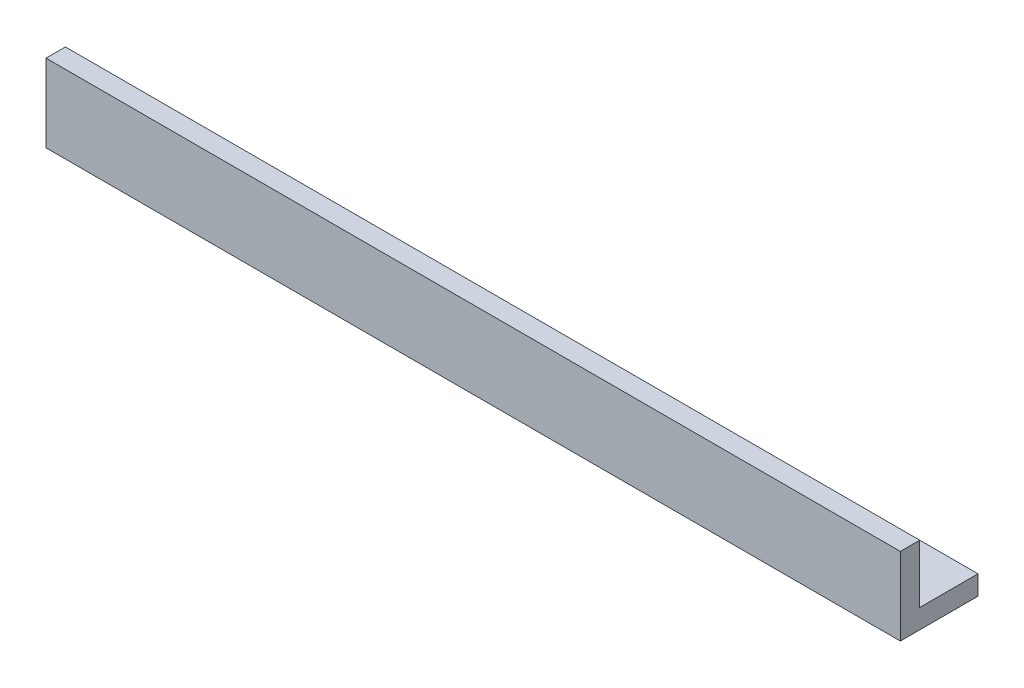
ISO-10303-21;
HEADER;
FILE_DESCRIPTION(('STEP AP214'),'2;1');
FILE_NAME('part.step','',(''),(''),'','','');
FILE_SCHEMA(('AUTOMOTIVE_DESIGN { 1 0 10303 214 1 1 1 1 }'));
ENDSEC;
DATA;
#1=APPLICATION_CONTEXT('core data for automotive mechanical design processes');
#2=APPLICATION_PROTOCOL_DEFINITION('international standard','automotive_design',2000,#1);
#3=PRODUCT_CONTEXT('',#1,'mechanical');
#4=PRODUCT('Part','Part','',(#3));
#5=PRODUCT_RELATED_PRODUCT_CATEGORY('part','',(#4));
#6=PRODUCT_DEFINITION_FORMATION('','',#4);
#7=PRODUCT_DEFINITION_CONTEXT('part definition',#1,'design');
#8=PRODUCT_DEFINITION('design','',#6,#7);
#9=PRODUCT_DEFINITION_SHAPE('','',#8);
#10=(LENGTH_UNIT() NAMED_UNIT(*) SI_UNIT(.MILLI.,.METRE.));
#11=(NAMED_UNIT(*) PLANE_ANGLE_UNIT() SI_UNIT($,.RADIAN.));
#12=(NAMED_UNIT(*) SI_UNIT($,.STERADIAN.) SOLID_ANGLE_UNIT());
#13=UNCERTAINTY_MEASURE_WITH_UNIT(LENGTH_MEASURE(1.E-05),#10,'distance_accuracy_value','');
#14=(GEOMETRIC_REPRESENTATION_CONTEXT(3) GLOBAL_UNCERTAINTY_ASSIGNED_CONTEXT((#13)) GLOBAL_UNIT_ASSIGNED_CONTEXT((#10,
#11,#12)) REPRESENTATION_CONTEXT('',''));
#15=CARTESIAN_POINT('',(0.,0.,0.));
#16=DIRECTION('',(0.,0.,1.));
#17=DIRECTION('',(1.,0.,0.));
#18=AXIS2_PLACEMENT_3D('',#15,#16,#17);
#19=CARTESIAN_POINT('',(-67.9135273568716,28.7042734044365,3.175));
#20=DIRECTION('',(1.,0.,0.));
#21=DIRECTION('',(0.,0.,-1.));
#22=AXIS2_PLACEMENT_3D('',#19,#20,#21);
#23=PLANE('',#22);
#24=DIRECTION('',(0.,-1.,0.));
#25=VECTOR('',#24,1.);
#26=CARTESIAN_POINT('',(-67.9135273568716,28.7042734044365,0.));
#27=LINE('',#26,#25);
#28=CARTESIAN_POINT('',(-67.9135273568716,28.7042734044365,0.));
#29=VERTEX_POINT('',#28);
#30=CARTESIAN_POINT('',(-67.9135273568716,19.1792734044365,0.));
#31=VERTEX_POINT('',#30);
#32=EDGE_CURVE('E135',#29,#31,#27,.T.);
#33=ORIENTED_EDGE('',*,*,#32,.T.);
#34=DIRECTION('',(0.,0.,-1.));
#35=VECTOR('',#34,1.);
#36=CARTESIAN_POINT('',(-67.9135273568716,19.1792734044365,-9.525));
#37=LINE('',#36,#35);
#38=CARTESIAN_POINT('',(-67.9135273568716,19.1792734044365,-9.525));
#39=VERTEX_POINT('',#38);
#40=EDGE_CURVE('E58',#31,#39,#37,.T.);
#41=ORIENTED_EDGE('',*,*,#40,.T.);
#42=DIRECTION('',(0.,-1.,0.));
#43=VECTOR('',#42,1.);
#44=CARTESIAN_POINT('',(-67.9135273568716,19.1792734044365,-9.525));
#45=LINE('',#44,#43);
#46=CARTESIAN_POINT('',(-67.9135273568716,16.0042734044365,-9.525));
#47=VERTEX_POINT('',#46);
#48=EDGE_CURVE('E116',#39,#47,#45,.T.);
#49=ORIENTED_EDGE('',*,*,#48,.T.);
#50=DIRECTION('',(0.,0.,-1.));
#51=VECTOR('',#50,1.);
#52=CARTESIAN_POINT('',(-67.9135273568716,16.0042734044365,3.175));
#53=LINE('',#52,#51);
#54=CARTESIAN_POINT('',(-67.9135273568716,16.0042734044365,3.175));
#55=VERTEX_POINT('',#54);
#56=EDGE_CURVE('E11',#55,#47,#53,.T.);
#57=ORIENTED_EDGE('',*,*,#56,.F.);
#58=DIRECTION('',(0.,-1.,0.));
#59=VECTOR('',#58,1.);
#60=CARTESIAN_POINT('',(-67.9135273568716,28.7042734044365,3.175));
#61=LINE('',#60,#59);
#62=CARTESIAN_POINT('',(-67.9135273568716,28.7042734044365,3.175));
#63=VERTEX_POINT('',#62);
#64=EDGE_CURVE('E147',#63,#55,#61,.T.);
#65=ORIENTED_EDGE('',*,*,#64,.F.);
#66=DIRECTION('',(0.,0.,-1.));
#67=VECTOR('',#66,1.);
#68=CARTESIAN_POINT('',(-67.9135273568716,28.7042734044365,3.175));
#69=LINE('',#68,#67);
#70=EDGE_CURVE('E157',#63,#29,#69,.T.);
#71=ORIENTED_EDGE('',*,*,#70,.T.);
#72=EDGE_LOOP('',(#33,#41,#49,#57,#65,#71));
#73=FACE_BOUND('',#72,.T.);
#74=ADVANCED_FACE('F40',(#73),#23,.F.);
#75=CARTESIAN_POINT('',(-67.9135273568716,16.0042734044365,3.175));
#76=DIRECTION('',(0.,1.,0.));
#77=DIRECTION('',(0.,0.,1.));
#78=AXIS2_PLACEMENT_3D('',#75,#76,#77);
#79=PLANE('',#78);
#80=ORIENTED_EDGE('',*,*,#56,.T.);
#81=DIRECTION('',(1.,0.,0.));
#82=VECTOR('',#81,1.);
#83=CARTESIAN_POINT('',(-67.9135273568716,16.0042734044365,-9.525));
#84=LINE('',#83,#82);
#85=CARTESIAN_POINT('',(71.7864726431284,16.0042734044365,-9.52499999999998));
#86=VERTEX_POINT('',#85);
#87=EDGE_CURVE('E121',#47,#86,#84,.T.);
#88=ORIENTED_EDGE('',*,*,#87,.T.);
#89=DIRECTION('',(0.,0.,-1.));
#90=VECTOR('',#89,1.);
#91=CARTESIAN_POINT('',(71.7864726431284,16.0042734044365,3.175));
#92=LINE('',#91,#90);
#93=CARTESIAN_POINT('',(71.7864726431284,16.0042734044365,3.175));
#94=VERTEX_POINT('',#93);
#95=EDGE_CURVE('E48',#94,#86,#92,.T.);
#96=ORIENTED_EDGE('',*,*,#95,.F.);
#97=DIRECTION('',(1.,0.,0.));
#98=VECTOR('',#97,1.);
#99=CARTESIAN_POINT('',(-67.9135273568716,16.0042734044365,3.175));
#100=LINE('',#99,#98);
#101=EDGE_CURVE('E96',#55,#94,#100,.T.);
#102=ORIENTED_EDGE('',*,*,#101,.F.);
#103=EDGE_LOOP('',(#80,#88,#96,#102));
#104=FACE_BOUND('',#103,.T.);
#105=ADVANCED_FACE('F174',(#104),#79,.F.);
#106=CARTESIAN_POINT('',(71.7864726431284,28.7042734044365,3.175));
#107=DIRECTION('',(-1.,0.,0.));
#108=DIRECTION('',(0.,0.,1.));
#109=AXIS2_PLACEMENT_3D('',#106,#107,#108);
#110=PLANE('',#109);
#111=ORIENTED_EDGE('',*,*,#95,.T.);
#112=DIRECTION('',(0.,-1.,0.));
#113=VECTOR('',#112,1.);
#114=CARTESIAN_POINT('',(71.7864726431284,19.1792734044365,-9.52499999999998));
#115=LINE('',#114,#113);
#116=CARTESIAN_POINT('',(71.7864726431284,19.1792734044365,-9.52499999999998));
#117=VERTEX_POINT('',#116);
#118=EDGE_CURVE('E125',#117,#86,#115,.T.);
#119=ORIENTED_EDGE('',*,*,#118,.F.);
#120=DIRECTION('',(0.,0.,1.));
#121=VECTOR('',#120,1.);
#122=CARTESIAN_POINT('',(71.7864726431284,19.1792734044365,-9.52499999999998));
#123=LINE('',#122,#121);
#124=CARTESIAN_POINT('',(71.7864726431284,19.1792734044365,0.));
#125=VERTEX_POINT('',#124);
#126=EDGE_CURVE('E130',#117,#125,#123,.T.);
#127=ORIENTED_EDGE('',*,*,#126,.T.);
#128=DIRECTION('',(0.,1.,0.));
#129=VECTOR('',#128,1.);
#130=CARTESIAN_POINT('',(71.7864726431284,28.7042734044365,0.));
#131=LINE('',#130,#129);
#132=CARTESIAN_POINT('',(71.7864726431284,28.7042734044365,0.));
#133=VERTEX_POINT('',#132);
#134=EDGE_CURVE('E160',#125,#133,#131,.T.);
#135=ORIENTED_EDGE('',*,*,#134,.T.);
#136=DIRECTION('',(0.,0.,-1.));
#137=VECTOR('',#136,1.);
#138=CARTESIAN_POINT('',(71.7864726431284,28.7042734044365,3.175));
#139=LINE('',#138,#137);
#140=CARTESIAN_POINT('',(71.7864726431284,28.7042734044365,3.175));
#141=VERTEX_POINT('',#140);
#142=EDGE_CURVE('E167',#141,#133,#139,.T.);
#143=ORIENTED_EDGE('',*,*,#142,.F.);
#144=DIRECTION('',(0.,1.,0.));
#145=VECTOR('',#144,1.);
#146=CARTESIAN_POINT('',(71.7864726431284,28.7042734044365,3.175));
#147=LINE('',#146,#145);
#148=EDGE_CURVE('E152',#94,#141,#147,.T.);
#149=ORIENTED_EDGE('',*,*,#148,.F.);
#150=EDGE_LOOP('',(#111,#119,#127,#135,#143,#149));
#151=FACE_BOUND('',#150,.T.);
#152=ADVANCED_FACE('F172',(#151),#110,.F.);
#153=CARTESIAN_POINT('',(-67.9135273568716,28.7042734044365,3.175));
#154=DIRECTION('',(0.,-1.,0.));
#155=DIRECTION('',(0.,0.,-1.));
#156=AXIS2_PLACEMENT_3D('',#153,#154,#155);
#157=PLANE('',#156);
#158=DIRECTION('',(-1.,0.,0.));
#159=VECTOR('',#158,1.);
#160=CARTESIAN_POINT('',(-67.9135273568716,28.7042734044365,0.));
#161=LINE('',#160,#159);
#162=EDGE_CURVE('E87',#133,#29,#161,.T.);
#163=ORIENTED_EDGE('',*,*,#162,.T.);
#164=ORIENTED_EDGE('',*,*,#70,.F.);
#165=DIRECTION('',(-1.,0.,0.));
#166=VECTOR('',#165,1.);
#167=CARTESIAN_POINT('',(-67.9135273568716,28.7042734044365,3.175));
#168=LINE('',#167,#166);
#169=EDGE_CURVE('E69',#141,#63,#168,.T.);
#170=ORIENTED_EDGE('',*,*,#169,.F.);
#171=ORIENTED_EDGE('',*,*,#142,.T.);
#172=EDGE_LOOP('',(#163,#164,#170,#171));
#173=FACE_BOUND('',#172,.T.);
#174=ADVANCED_FACE('F178',(#173),#157,.F.);
#175=CARTESIAN_POINT('',(0.,0.,3.175));
#176=DIRECTION('',(0.,0.,1.));
#177=DIRECTION('',(1.,0.,0.));
#178=AXIS2_PLACEMENT_3D('',#175,#176,#177);
#179=PLANE('',#178);
#180=ORIENTED_EDGE('',*,*,#64,.T.);
#181=ORIENTED_EDGE('',*,*,#101,.T.);
#182=ORIENTED_EDGE('',*,*,#148,.T.);
#183=ORIENTED_EDGE('',*,*,#169,.T.);
#184=EDGE_LOOP('',(#180,#181,#182,#183));
#185=FACE_BOUND('',#184,.T.);
#186=ADVANCED_FACE('F176',(#185),#179,.T.);
#187=CARTESIAN_POINT('',(0.,0.,0.));
#188=DIRECTION('',(0.,0.,1.));
#189=DIRECTION('',(1.,0.,0.));
#190=AXIS2_PLACEMENT_3D('',#187,#188,#189);
#191=PLANE('',#190);
#192=ORIENTED_EDGE('',*,*,#134,.F.);
#193=DIRECTION('',(-1.,0.,0.));
#194=VECTOR('',#193,1.);
#195=CARTESIAN_POINT('',(-67.9135273568716,19.1792734044365,0.));
#196=LINE('',#195,#194);
#197=EDGE_CURVE('E126',#125,#31,#196,.T.);
#198=ORIENTED_EDGE('',*,*,#197,.T.);
#199=ORIENTED_EDGE('',*,*,#32,.F.);
#200=ORIENTED_EDGE('',*,*,#162,.F.);
#201=EDGE_LOOP('',(#192,#198,#199,#200));
#202=FACE_BOUND('',#201,.T.);
#203=ADVANCED_FACE('F185',(#202),#191,.F.);
#204=CARTESIAN_POINT('',(-67.9135273568716,19.1792734044365,-9.525));
#205=DIRECTION('',(0.,0.,-1.));
#206=DIRECTION('',(-1.,0.,0.));
#207=AXIS2_PLACEMENT_3D('',#204,#205,#206);
#208=PLANE('',#207);
#209=ORIENTED_EDGE('',*,*,#87,.F.);
#210=ORIENTED_EDGE('',*,*,#48,.F.);
#211=DIRECTION('',(1.,0.,0.));
#212=VECTOR('',#211,1.);
#213=CARTESIAN_POINT('',(-67.9135273568716,19.1792734044365,-9.525));
#214=LINE('',#213,#212);
#215=EDGE_CURVE('E119',#39,#117,#214,.T.);
#216=ORIENTED_EDGE('',*,*,#215,.T.);
#217=ORIENTED_EDGE('',*,*,#118,.T.);
#218=EDGE_LOOP('',(#209,#210,#216,#217));
#219=FACE_BOUND('',#218,.T.);
#220=ADVANCED_FACE('F117',(#219),#208,.T.);
#221=CARTESIAN_POINT('',(0.,19.1792734044365,0.));
#222=DIRECTION('',(0.,1.,0.));
#223=DIRECTION('',(0.,0.,1.));
#224=AXIS2_PLACEMENT_3D('',#221,#222,#223);
#225=PLANE('',#224);
#226=ORIENTED_EDGE('',*,*,#40,.F.);
#227=ORIENTED_EDGE('',*,*,#197,.F.);
#228=ORIENTED_EDGE('',*,*,#126,.F.);
#229=ORIENTED_EDGE('',*,*,#215,.F.);
#230=EDGE_LOOP('',(#226,#227,#228,#229));
#231=FACE_BOUND('',#230,.T.);
#232=ADVANCED_FACE('F129',(#231),#225,.T.);
#233=CLOSED_SHELL('',(#74,#105,#152,#174,#186,#203,#220,#232));
#234=MANIFOLD_SOLID_BREP('B2',#233);
#235=ADVANCED_BREP_SHAPE_REPRESENTATION('',(#18,#234),#14);
#236=SHAPE_DEFINITION_REPRESENTATION(#9,#235);
ENDSEC;
END-ISO-10303-21;
